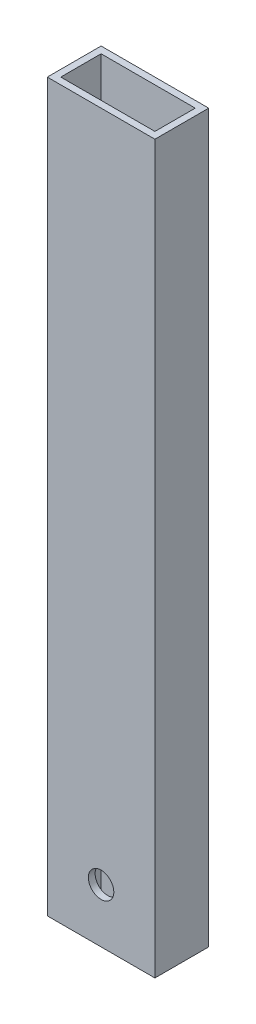
ISO-10303-21;
HEADER;
FILE_DESCRIPTION(('STEP AP214'),'2;1');
FILE_NAME('part.step','',(''),(''),'','','');
FILE_SCHEMA(('AUTOMOTIVE_DESIGN { 1 0 10303 214 1 1 1 1 }'));
ENDSEC;
DATA;
#1=APPLICATION_CONTEXT('core data for automotive mechanical design processes');
#2=APPLICATION_PROTOCOL_DEFINITION('international standard','automotive_design',2000,#1);
#3=PRODUCT_CONTEXT('',#1,'mechanical');
#4=PRODUCT('Part','Part','',(#3));
#5=PRODUCT_RELATED_PRODUCT_CATEGORY('part','',(#4));
#6=PRODUCT_DEFINITION_FORMATION('','',#4);
#7=PRODUCT_DEFINITION_CONTEXT('part definition',#1,'design');
#8=PRODUCT_DEFINITION('design','',#6,#7);
#9=PRODUCT_DEFINITION_SHAPE('','',#8);
#10=(LENGTH_UNIT() NAMED_UNIT(*) SI_UNIT(.MILLI.,.METRE.));
#11=(NAMED_UNIT(*) PLANE_ANGLE_UNIT() SI_UNIT($,.RADIAN.));
#12=(NAMED_UNIT(*) SI_UNIT($,.STERADIAN.) SOLID_ANGLE_UNIT());
#13=UNCERTAINTY_MEASURE_WITH_UNIT(LENGTH_MEASURE(1.E-05),#10,'distance_accuracy_value','');
#14=(GEOMETRIC_REPRESENTATION_CONTEXT(3) GLOBAL_UNCERTAINTY_ASSIGNED_CONTEXT((#13)) GLOBAL_UNIT_ASSIGNED_CONTEXT((#10,
#11,#12)) REPRESENTATION_CONTEXT('',''));
#15=CARTESIAN_POINT('',(0.,0.,0.));
#16=DIRECTION('',(0.,0.,1.));
#17=DIRECTION('',(1.,0.,0.));
#18=AXIS2_PLACEMENT_3D('',#15,#16,#17);
#19=CARTESIAN_POINT('',(-15.1862433862434,355.6,12.0280423280423));
#20=DIRECTION('',(1.,0.,0.));
#21=DIRECTION('',(0.,0.,-1.));
#22=AXIS2_PLACEMENT_3D('',#19,#20,#21);
#23=PLANE('',#22);
#24=DIRECTION('',(0.,0.,1.));
#25=VECTOR('',#24,1.);
#26=CARTESIAN_POINT('',(-15.1862433862434,317.5,-13.3719576719577));
#27=LINE('',#26,#25);
#28=CARTESIAN_POINT('',(-15.1862433862434,317.5,-13.3719576719577));
#29=VERTEX_POINT('',#28);
#30=CARTESIAN_POINT('',(-15.1862433862434,317.5,12.0280423280423));
#31=VERTEX_POINT('',#30);
#32=EDGE_CURVE('E129',#29,#31,#27,.T.);
#33=ORIENTED_EDGE('',*,*,#32,.F.);
#34=DIRECTION('',(0.,-1.,0.));
#35=VECTOR('',#34,1.);
#36=CARTESIAN_POINT('',(-15.1862433862434,355.6,-13.3719576719577));
#37=LINE('',#36,#35);
#38=CARTESIAN_POINT('',(-15.1862433862434,-25.4,-13.3719576719577));
#39=VERTEX_POINT('',#38);
#40=EDGE_CURVE('E139',#29,#39,#37,.T.);
#41=ORIENTED_EDGE('',*,*,#40,.T.);
#42=DIRECTION('',(0.,0.,-1.));
#43=VECTOR('',#42,1.);
#44=CARTESIAN_POINT('',(-15.1862433862434,-25.4,12.0280423280423));
#45=LINE('',#44,#43);
#46=CARTESIAN_POINT('',(-15.1862433862434,-25.4,12.0280423280423));
#47=VERTEX_POINT('',#46);
#48=EDGE_CURVE('E204',#47,#39,#45,.T.);
#49=ORIENTED_EDGE('',*,*,#48,.F.);
#50=DIRECTION('',(0.,-1.,0.));
#51=VECTOR('',#50,1.);
#52=CARTESIAN_POINT('',(-15.1862433862434,355.6,12.0280423280423));
#53=LINE('',#52,#51);
#54=EDGE_CURVE('E73',#31,#47,#53,.T.);
#55=ORIENTED_EDGE('',*,*,#54,.F.);
#56=EDGE_LOOP('',(#33,#41,#49,#55));
#57=FACE_BOUND('',#56,.T.);
#58=ADVANCED_FACE('F65',(#57),#23,.F.);
#59=CARTESIAN_POINT('',(-15.1862433862434,355.6,12.0280423280423));
#60=DIRECTION('',(0.,0.,-1.));
#61=DIRECTION('',(-1.,0.,0.));
#62=AXIS2_PLACEMENT_3D('',#59,#60,#61);
#63=PLANE('',#62);
#64=CARTESIAN_POINT('',(10.2137566137566,0.,12.0280423280423));
#65=DIRECTION('',(0.,0.,-1.));
#66=DIRECTION('',(-1.,0.,0.));
#67=AXIS2_PLACEMENT_3D('',#64,#65,#66);
#68=CIRCLE('',#67,6.);
#69=CARTESIAN_POINT('',(4.21375661375661,0.,12.0280423280423));
#70=VERTEX_POINT('',#69);
#71=EDGE_CURVE('E167',#70,#70,#68,.F.);
#72=ORIENTED_EDGE('',*,*,#71,.F.);
#73=EDGE_LOOP('',(#72));
#74=FACE_BOUND('',#73,.T.);
#75=DIRECTION('',(1.,0.,0.));
#76=VECTOR('',#75,1.);
#77=CARTESIAN_POINT('',(-15.1862433862434,317.5,12.0280423280423));
#78=LINE('',#77,#76);
#79=CARTESIAN_POINT('',(35.6137566137566,317.5,12.0280423280423));
#80=VERTEX_POINT('',#79);
#81=EDGE_CURVE('E142',#31,#80,#78,.T.);
#82=ORIENTED_EDGE('',*,*,#81,.F.);
#83=ORIENTED_EDGE('',*,*,#54,.T.);
#84=DIRECTION('',(-1.,0.,0.));
#85=VECTOR('',#84,1.);
#86=CARTESIAN_POINT('',(35.6137566137566,-25.4,12.0280423280423));
#87=LINE('',#86,#85);
#88=CARTESIAN_POINT('',(35.6137566137566,-25.4,12.0280423280423));
#89=VERTEX_POINT('',#88);
#90=EDGE_CURVE('E200',#89,#47,#87,.T.);
#91=ORIENTED_EDGE('',*,*,#90,.F.);
#92=DIRECTION('',(0.,-1.,0.));
#93=VECTOR('',#92,1.);
#94=CARTESIAN_POINT('',(35.6137566137566,355.6,12.0280423280423));
#95=LINE('',#94,#93);
#96=EDGE_CURVE('E154',#80,#89,#95,.T.);
#97=ORIENTED_EDGE('',*,*,#96,.F.);
#98=EDGE_LOOP('',(#82,#83,#91,#97));
#99=FACE_BOUND('',#98,.T.);
#100=ADVANCED_FACE('F254',(#74,#99),#63,.F.);
#101=CARTESIAN_POINT('',(35.6137566137566,355.6,12.0280423280423));
#102=DIRECTION('',(-1.,0.,0.));
#103=DIRECTION('',(0.,0.,1.));
#104=AXIS2_PLACEMENT_3D('',#101,#102,#103);
#105=PLANE('',#104);
#106=DIRECTION('',(0.,0.,-1.));
#107=VECTOR('',#106,1.);
#108=CARTESIAN_POINT('',(35.6137566137566,317.5,12.0280423280423));
#109=LINE('',#108,#107);
#110=CARTESIAN_POINT('',(35.6137566137566,317.5,-13.3719576719577));
#111=VERTEX_POINT('',#110);
#112=EDGE_CURVE('E80',#80,#111,#109,.T.);
#113=ORIENTED_EDGE('',*,*,#112,.F.);
#114=ORIENTED_EDGE('',*,*,#96,.T.);
#115=DIRECTION('',(0.,0.,1.));
#116=VECTOR('',#115,1.);
#117=CARTESIAN_POINT('',(35.6137566137566,-25.4,-13.3719576719577));
#118=LINE('',#117,#116);
#119=CARTESIAN_POINT('',(35.6137566137566,-25.4,-13.3719576719577));
#120=VERTEX_POINT('',#119);
#121=EDGE_CURVE('E209',#120,#89,#118,.T.);
#122=ORIENTED_EDGE('',*,*,#121,.F.);
#123=DIRECTION('',(0.,-1.,0.));
#124=VECTOR('',#123,1.);
#125=CARTESIAN_POINT('',(35.6137566137566,355.6,-13.3719576719577));
#126=LINE('',#125,#124);
#127=EDGE_CURVE('E149',#111,#120,#126,.T.);
#128=ORIENTED_EDGE('',*,*,#127,.F.);
#129=EDGE_LOOP('',(#113,#114,#122,#128));
#130=FACE_BOUND('',#129,.T.);
#131=ADVANCED_FACE('F251',(#130),#105,.F.);
#132=CARTESIAN_POINT('',(-15.1862433862434,355.6,-13.3719576719577));
#133=DIRECTION('',(0.,0.,1.));
#134=DIRECTION('',(1.,0.,0.));
#135=AXIS2_PLACEMENT_3D('',#132,#133,#134);
#136=PLANE('',#135);
#137=CARTESIAN_POINT('',(10.2137566137566,0.,-13.3719576719577));
#138=DIRECTION('',(0.,0.,-1.));
#139=DIRECTION('',(-1.,0.,0.));
#140=AXIS2_PLACEMENT_3D('',#137,#138,#139);
#141=CIRCLE('',#140,6.);
#142=CARTESIAN_POINT('',(4.21375661375661,0.,-13.3719576719577));
#143=VERTEX_POINT('',#142);
#144=EDGE_CURVE('E176',#143,#143,#141,.T.);
#145=ORIENTED_EDGE('',*,*,#144,.F.);
#146=EDGE_LOOP('',(#145));
#147=FACE_BOUND('',#146,.T.);
#148=DIRECTION('',(-1.,0.,0.));
#149=VECTOR('',#148,1.);
#150=CARTESIAN_POINT('',(35.6137566137566,317.5,-13.3719576719577));
#151=LINE('',#150,#149);
#152=EDGE_CURVE('E126',#111,#29,#151,.T.);
#153=ORIENTED_EDGE('',*,*,#152,.F.);
#154=ORIENTED_EDGE('',*,*,#127,.T.);
#155=DIRECTION('',(1.,0.,0.));
#156=VECTOR('',#155,1.);
#157=CARTESIAN_POINT('',(-15.1862433862434,-25.4,-13.3719576719577));
#158=LINE('',#157,#156);
#159=EDGE_CURVE('E147',#39,#120,#158,.T.);
#160=ORIENTED_EDGE('',*,*,#159,.F.);
#161=ORIENTED_EDGE('',*,*,#40,.F.);
#162=EDGE_LOOP('',(#153,#154,#160,#161));
#163=FACE_BOUND('',#162,.T.);
#164=ADVANCED_FACE('F145',(#147,#163),#136,.F.);
#165=CARTESIAN_POINT('',(-12.0112433862434,355.6,0.));
#166=DIRECTION('',(1.,0.,0.));
#167=DIRECTION('',(0.,0.,-1.));
#168=AXIS2_PLACEMENT_3D('',#165,#166,#167);
#169=PLANE('',#168);
#170=DIRECTION('',(0.,-1.,0.));
#171=VECTOR('',#170,1.);
#172=CARTESIAN_POINT('',(-12.0112433862434,355.6,-10.1969576719577));
#173=LINE('',#172,#171);
#174=CARTESIAN_POINT('',(-12.0112433862434,317.5,-10.1969576719577));
#175=VERTEX_POINT('',#174);
#176=CARTESIAN_POINT('',(-12.0112433862434,-25.4,-10.1969576719577));
#177=VERTEX_POINT('',#176);
#178=EDGE_CURVE('E213',#175,#177,#173,.T.);
#179=ORIENTED_EDGE('',*,*,#178,.F.);
#180=DIRECTION('',(0.,0.,1.));
#181=VECTOR('',#180,1.);
#182=CARTESIAN_POINT('',(-12.0112433862434,317.5,0.));
#183=LINE('',#182,#181);
#184=CARTESIAN_POINT('',(-12.0112433862434,317.5,8.85304232804233));
#185=VERTEX_POINT('',#184);
#186=EDGE_CURVE('E88',#175,#185,#183,.T.);
#187=ORIENTED_EDGE('',*,*,#186,.T.);
#188=DIRECTION('',(0.,-1.,0.));
#189=VECTOR('',#188,1.);
#190=CARTESIAN_POINT('',(-12.0112433862434,355.6,8.85304232804233));
#191=LINE('',#190,#189);
#192=CARTESIAN_POINT('',(-12.0112433862434,-25.4,8.85304232804233));
#193=VERTEX_POINT('',#192);
#194=EDGE_CURVE('E150',#185,#193,#191,.T.);
#195=ORIENTED_EDGE('',*,*,#194,.T.);
#196=DIRECTION('',(0.,0.,-1.));
#197=VECTOR('',#196,1.);
#198=CARTESIAN_POINT('',(-12.0112433862434,-25.4,-10.1969576719577));
#199=LINE('',#198,#197);
#200=EDGE_CURVE('E196',#193,#177,#199,.T.);
#201=ORIENTED_EDGE('',*,*,#200,.T.);
#202=EDGE_LOOP('',(#179,#187,#195,#201));
#203=FACE_BOUND('',#202,.T.);
#204=ADVANCED_FACE('F237',(#203),#169,.T.);
#205=CARTESIAN_POINT('',(0.,355.6,8.85304232804233));
#206=DIRECTION('',(0.,0.,-1.));
#207=DIRECTION('',(-1.,0.,0.));
#208=AXIS2_PLACEMENT_3D('',#205,#206,#207);
#209=PLANE('',#208);
#210=CARTESIAN_POINT('',(10.2137566137566,0.,8.85304232804233));
#211=DIRECTION('',(0.,0.,-1.));
#212=DIRECTION('',(-1.,0.,0.));
#213=AXIS2_PLACEMENT_3D('',#210,#211,#212);
#214=CIRCLE('',#213,6.);
#215=CARTESIAN_POINT('',(4.21375661375661,0.,8.85304232804233));
#216=VERTEX_POINT('',#215);
#217=EDGE_CURVE('E166',#216,#216,#214,.T.);
#218=ORIENTED_EDGE('',*,*,#217,.F.);
#219=EDGE_LOOP('',(#218));
#220=FACE_BOUND('',#219,.T.);
#221=ORIENTED_EDGE('',*,*,#194,.F.);
#222=DIRECTION('',(1.,0.,0.));
#223=VECTOR('',#222,1.);
#224=CARTESIAN_POINT('',(0.,317.5,8.85304232804233));
#225=LINE('',#224,#223);
#226=CARTESIAN_POINT('',(32.4387566137566,317.5,8.85304232804233));
#227=VERTEX_POINT('',#226);
#228=EDGE_CURVE('E226',#185,#227,#225,.T.);
#229=ORIENTED_EDGE('',*,*,#228,.T.);
#230=DIRECTION('',(0.,-1.,0.));
#231=VECTOR('',#230,1.);
#232=CARTESIAN_POINT('',(32.4387566137566,355.6,8.85304232804233));
#233=LINE('',#232,#231);
#234=CARTESIAN_POINT('',(32.4387566137566,-25.4,8.85304232804233));
#235=VERTEX_POINT('',#234);
#236=EDGE_CURVE('E156',#227,#235,#233,.T.);
#237=ORIENTED_EDGE('',*,*,#236,.T.);
#238=DIRECTION('',(-1.,0.,0.));
#239=VECTOR('',#238,1.);
#240=CARTESIAN_POINT('',(-12.0112433862434,-25.4,8.85304232804233));
#241=LINE('',#240,#239);
#242=EDGE_CURVE('E192',#235,#193,#241,.T.);
#243=ORIENTED_EDGE('',*,*,#242,.T.);
#244=EDGE_LOOP('',(#221,#229,#237,#243));
#245=FACE_BOUND('',#244,.T.);
#246=ADVANCED_FACE('F223',(#220,#245),#209,.T.);
#247=CARTESIAN_POINT('',(32.4387566137566,355.6,0.));
#248=DIRECTION('',(-1.,0.,0.));
#249=DIRECTION('',(0.,0.,1.));
#250=AXIS2_PLACEMENT_3D('',#247,#248,#249);
#251=PLANE('',#250);
#252=ORIENTED_EDGE('',*,*,#236,.F.);
#253=DIRECTION('',(0.,0.,-1.));
#254=VECTOR('',#253,1.);
#255=CARTESIAN_POINT('',(32.4387566137566,317.5,0.));
#256=LINE('',#255,#254);
#257=CARTESIAN_POINT('',(32.4387566137566,317.5,-10.1969576719577));
#258=VERTEX_POINT('',#257);
#259=EDGE_CURVE('E240',#227,#258,#256,.T.);
#260=ORIENTED_EDGE('',*,*,#259,.T.);
#261=DIRECTION('',(0.,-1.,0.));
#262=VECTOR('',#261,1.);
#263=CARTESIAN_POINT('',(32.4387566137566,355.6,-10.1969576719577));
#264=LINE('',#263,#262);
#265=CARTESIAN_POINT('',(32.4387566137566,-25.4,-10.1969576719577));
#266=VERTEX_POINT('',#265);
#267=EDGE_CURVE('E216',#258,#266,#264,.T.);
#268=ORIENTED_EDGE('',*,*,#267,.T.);
#269=DIRECTION('',(0.,0.,1.));
#270=VECTOR('',#269,1.);
#271=CARTESIAN_POINT('',(32.4387566137566,-25.4,8.85304232804233));
#272=LINE('',#271,#270);
#273=EDGE_CURVE('E188',#266,#235,#272,.T.);
#274=ORIENTED_EDGE('',*,*,#273,.T.);
#275=EDGE_LOOP('',(#252,#260,#268,#274));
#276=FACE_BOUND('',#275,.T.);
#277=ADVANCED_FACE('F230',(#276),#251,.T.);
#278=CARTESIAN_POINT('',(0.,355.6,-10.1969576719577));
#279=DIRECTION('',(0.,0.,1.));
#280=DIRECTION('',(1.,0.,0.));
#281=AXIS2_PLACEMENT_3D('',#278,#279,#280);
#282=PLANE('',#281);
#283=CARTESIAN_POINT('',(10.2137566137566,0.,-10.1969576719577));
#284=DIRECTION('',(0.,0.,1.));
#285=DIRECTION('',(1.,0.,0.));
#286=AXIS2_PLACEMENT_3D('',#283,#284,#285);
#287=CIRCLE('',#286,6.);
#288=CARTESIAN_POINT('',(16.2137566137566,0.,-10.1969576719577));
#289=VERTEX_POINT('',#288);
#290=EDGE_CURVE('E163',#289,#289,#287,.T.);
#291=ORIENTED_EDGE('',*,*,#290,.F.);
#292=EDGE_LOOP('',(#291));
#293=FACE_BOUND('',#292,.T.);
#294=ORIENTED_EDGE('',*,*,#267,.F.);
#295=DIRECTION('',(-1.,0.,0.));
#296=VECTOR('',#295,1.);
#297=CARTESIAN_POINT('',(0.,317.5,-10.1969576719577));
#298=LINE('',#297,#296);
#299=EDGE_CURVE('E12',#258,#175,#298,.T.);
#300=ORIENTED_EDGE('',*,*,#299,.T.);
#301=ORIENTED_EDGE('',*,*,#178,.T.);
#302=DIRECTION('',(1.,0.,0.));
#303=VECTOR('',#302,1.);
#304=CARTESIAN_POINT('',(32.4387566137566,-25.4,-10.1969576719577));
#305=LINE('',#304,#303);
#306=EDGE_CURVE('E173',#177,#266,#305,.T.);
#307=ORIENTED_EDGE('',*,*,#306,.T.);
#308=EDGE_LOOP('',(#294,#300,#301,#307));
#309=FACE_BOUND('',#308,.T.);
#310=ADVANCED_FACE('F258',(#293,#309),#282,.T.);
#311=CARTESIAN_POINT('',(0.,-25.4,0.));
#312=DIRECTION('',(0.,-1.,0.));
#313=DIRECTION('',(0.,0.,-1.));
#314=AXIS2_PLACEMENT_3D('',#311,#312,#313);
#315=PLANE('',#314);
#316=ORIENTED_EDGE('',*,*,#90,.T.);
#317=ORIENTED_EDGE('',*,*,#48,.T.);
#318=ORIENTED_EDGE('',*,*,#159,.T.);
#319=ORIENTED_EDGE('',*,*,#121,.T.);
#320=EDGE_LOOP('',(#316,#317,#318,#319));
#321=FACE_BOUND('',#320,.T.);
#322=ORIENTED_EDGE('',*,*,#273,.F.);
#323=ORIENTED_EDGE('',*,*,#306,.F.);
#324=ORIENTED_EDGE('',*,*,#200,.F.);
#325=ORIENTED_EDGE('',*,*,#242,.F.);
#326=EDGE_LOOP('',(#322,#323,#324,#325));
#327=FACE_BOUND('',#326,.T.);
#328=ADVANCED_FACE('F234',(#321,#327),#315,.T.);
#329=CARTESIAN_POINT('',(10.2137566137566,0.,28.9986050765195));
#330=DIRECTION('',(0.,0.,-1.));
#331=DIRECTION('',(-1.,0.,0.));
#332=AXIS2_PLACEMENT_3D('',#329,#330,#331);
#333=CYLINDRICAL_SURFACE('',#332,6.);
#334=ORIENTED_EDGE('',*,*,#290,.T.);
#335=EDGE_LOOP('',(#334));
#336=FACE_BOUND('',#335,.T.);
#337=ORIENTED_EDGE('',*,*,#144,.T.);
#338=EDGE_LOOP('',(#337));
#339=FACE_BOUND('',#338,.T.);
#340=ADVANCED_FACE('F257',(#336,#339),#333,.F.);
#341=ORIENTED_EDGE('',*,*,#217,.T.);
#342=EDGE_LOOP('',(#341));
#343=FACE_BOUND('',#342,.T.);
#344=ORIENTED_EDGE('',*,*,#71,.T.);
#345=EDGE_LOOP('',(#344));
#346=FACE_BOUND('',#345,.T.);
#347=ADVANCED_FACE('F264',(#343,#346),#333,.F.);
#348=CARTESIAN_POINT('',(0.,317.5,0.));
#349=DIRECTION('',(0.,1.,0.));
#350=DIRECTION('',(0.,0.,1.));
#351=AXIS2_PLACEMENT_3D('',#348,#349,#350);
#352=PLANE('',#351);
#353=ORIENTED_EDGE('',*,*,#299,.F.);
#354=ORIENTED_EDGE('',*,*,#259,.F.);
#355=ORIENTED_EDGE('',*,*,#228,.F.);
#356=ORIENTED_EDGE('',*,*,#186,.F.);
#357=EDGE_LOOP('',(#353,#354,#355,#356));
#358=FACE_BOUND('',#357,.T.);
#359=ORIENTED_EDGE('',*,*,#152,.T.);
#360=ORIENTED_EDGE('',*,*,#32,.T.);
#361=ORIENTED_EDGE('',*,*,#81,.T.);
#362=ORIENTED_EDGE('',*,*,#112,.T.);
#363=EDGE_LOOP('',(#359,#360,#361,#362));
#364=FACE_BOUND('',#363,.T.);
#365=ADVANCED_FACE('F128',(#358,#364),#352,.T.);
#366=CLOSED_SHELL('',(#58,#100,#131,#164,#204,#246,#277,#310,#328,#340,#347,#365));
#367=MANIFOLD_SOLID_BREP('B2',#366);
#368=ADVANCED_BREP_SHAPE_REPRESENTATION('',(#18,#367),#14);
#369=SHAPE_DEFINITION_REPRESENTATION(#9,#368);
ENDSEC;
END-ISO-10303-21;
